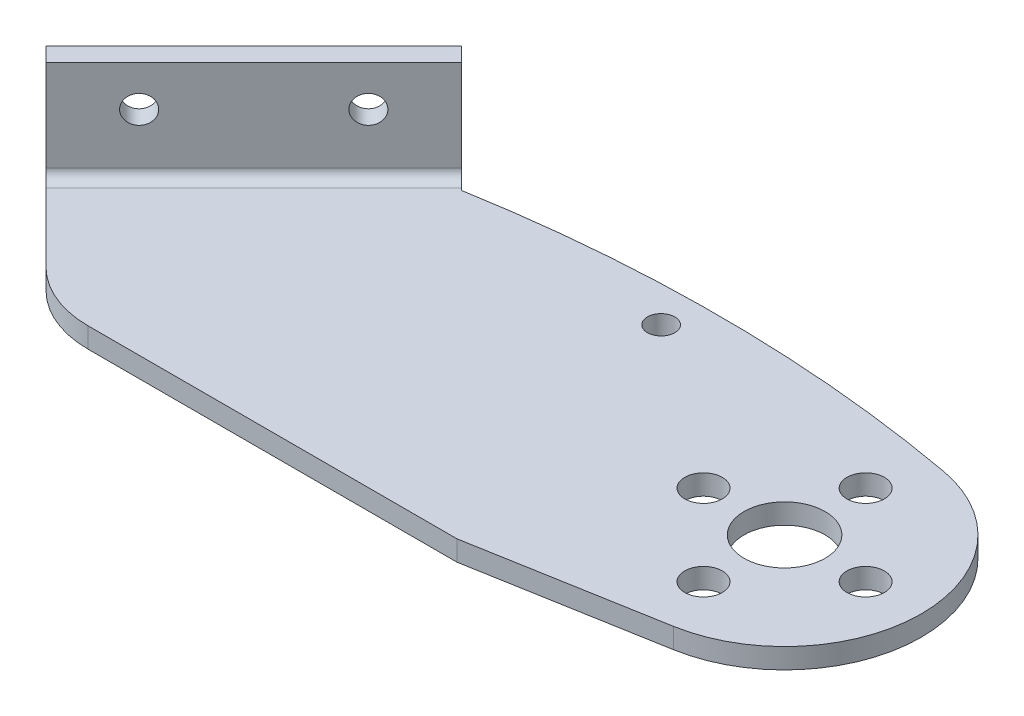
ISO-10303-21;
HEADER;
FILE_DESCRIPTION(('STEP AP214'),'2;1');
FILE_NAME('part.step','',(''),(''),'','','');
FILE_SCHEMA(('AUTOMOTIVE_DESIGN { 1 0 10303 214 1 1 1 1 }'));
ENDSEC;
DATA;
#1=APPLICATION_CONTEXT('core data for automotive mechanical design processes');
#2=APPLICATION_PROTOCOL_DEFINITION('international standard','automotive_design',2000,#1);
#3=PRODUCT_CONTEXT('',#1,'mechanical');
#4=PRODUCT('Part','Part','',(#3));
#5=PRODUCT_RELATED_PRODUCT_CATEGORY('part','',(#4));
#6=PRODUCT_DEFINITION_FORMATION('','',#4);
#7=PRODUCT_DEFINITION_CONTEXT('part definition',#1,'design');
#8=PRODUCT_DEFINITION('design','',#6,#7);
#9=PRODUCT_DEFINITION_SHAPE('','',#8);
#10=(LENGTH_UNIT() NAMED_UNIT(*) SI_UNIT(.MILLI.,.METRE.));
#11=(NAMED_UNIT(*) PLANE_ANGLE_UNIT() SI_UNIT($,.RADIAN.));
#12=(NAMED_UNIT(*) SI_UNIT($,.STERADIAN.) SOLID_ANGLE_UNIT());
#13=UNCERTAINTY_MEASURE_WITH_UNIT(LENGTH_MEASURE(1.E-05),#10,'distance_accuracy_value','');
#14=(GEOMETRIC_REPRESENTATION_CONTEXT(3) GLOBAL_UNCERTAINTY_ASSIGNED_CONTEXT((#13)) GLOBAL_UNIT_ASSIGNED_CONTEXT((#10,
#11,#12)) REPRESENTATION_CONTEXT('',''));
#15=CARTESIAN_POINT('',(0.,0.,0.));
#16=DIRECTION('',(0.,0.,1.));
#17=DIRECTION('',(1.,0.,0.));
#18=AXIS2_PLACEMENT_3D('',#15,#16,#17);
#19=CARTESIAN_POINT('',(13.7940246351911,8.,-9.12741699796952));
#20=DIRECTION('',(-0.707106781186548,0.,-0.707106781186547));
#21=DIRECTION('',(-0.707106781186548,0.,0.707106781186548));
#22=AXIS2_PLACEMENT_3D('',#19,#20,#21);
#23=CYLINDRICAL_SURFACE('',#22,1.36525);
#24=CARTESIAN_POINT('',(11.6727042916315,8.,-11.2487373415292));
#25=DIRECTION('',(-0.707106781186548,0.,-0.707106781186547));
#26=DIRECTION('',(-0.707106781186548,0.,0.707106781186548));
#27=AXIS2_PLACEMENT_3D('',#24,#25,#26);
#28=CIRCLE('',#27,1.36525);
#29=CARTESIAN_POINT('',(10.7073267586166,8.,-10.2833598085142));
#30=VERTEX_POINT('',#29);
#31=EDGE_CURVE('E177',#30,#30,#28,.T.);
#32=ORIENTED_EDGE('',*,*,#31,.T.);
#33=EDGE_LOOP('',(#32));
#34=FACE_BOUND('',#33,.T.);
#35=CARTESIAN_POINT('',(13.0869178540046,8.,-9.83452377915606));
#36=DIRECTION('',(-0.707106781186548,0.,-0.707106781186548));
#37=DIRECTION('',(-0.707106781186548,0.,0.707106781186548));
#38=AXIS2_PLACEMENT_3D('',#35,#36,#37);
#39=CIRCLE('',#38,1.36525);
#40=CARTESIAN_POINT('',(12.1215403209897,8.,-8.86914624614113));
#41=VERTEX_POINT('',#40);
#42=EDGE_CURVE('E228',#41,#41,#39,.T.);
#43=ORIENTED_EDGE('',*,*,#42,.F.);
#44=EDGE_LOOP('',(#43));
#45=FACE_BOUND('',#44,.T.);
#46=ADVANCED_FACE('F50',(#34,#45),#23,.F.);
#47=CARTESIAN_POINT('',(2.48031613620638,8.,2.18629150101524));
#48=DIRECTION('',(-0.707106781186548,0.,-0.707106781186547));
#49=DIRECTION('',(-0.707106781186548,0.,0.707106781186548));
#50=AXIS2_PLACEMENT_3D('',#47,#48,#49);
#51=CYLINDRICAL_SURFACE('',#50,1.36525);
#52=CARTESIAN_POINT('',(0.358995792646737,8.,0.0649711574556003));
#53=DIRECTION('',(-0.707106781186548,0.,-0.707106781186547));
#54=DIRECTION('',(-0.707106781186548,0.,0.707106781186548));
#55=AXIS2_PLACEMENT_3D('',#52,#53,#54);
#56=CIRCLE('',#55,1.36525);
#57=CARTESIAN_POINT('',(-0.606381740368197,8.,1.03034869047053));
#58=VERTEX_POINT('',#57);
#59=EDGE_CURVE('E247',#58,#58,#56,.T.);
#60=ORIENTED_EDGE('',*,*,#59,.T.);
#61=EDGE_LOOP('',(#60));
#62=FACE_BOUND('',#61,.T.);
#63=CARTESIAN_POINT('',(1.77320935501983,8.,1.4791847198287));
#64=DIRECTION('',(-0.707106781186548,0.,-0.707106781186548));
#65=DIRECTION('',(-0.707106781186548,0.,0.707106781186548));
#66=AXIS2_PLACEMENT_3D('',#63,#64,#65);
#67=CIRCLE('',#66,1.36525);
#68=CARTESIAN_POINT('',(0.8078318220049,8.,2.44456225284363));
#69=VERTEX_POINT('',#68);
#70=EDGE_CURVE('E233',#69,#69,#67,.T.);
#71=ORIENTED_EDGE('',*,*,#70,.F.);
#72=EDGE_LOOP('',(#71));
#73=FACE_BOUND('',#72,.T.);
#74=ADVANCED_FACE('F266',(#62,#73),#51,.F.);
#75=CARTESIAN_POINT('',(70.0090137395217,12.,37.8951839509359));
#76=DIRECTION('',(0.,1.,0.));
#77=DIRECTION('',(-0.707106781186548,0.,0.707106781186548));
#78=AXIS2_PLACEMENT_3D('',#75,#76,#77);
#79=PLANE('',#78);
#80=DIRECTION('',(-0.707106781186548,0.,-0.707106781186548));
#81=VECTOR('',#80,1.);
#82=CARTESIAN_POINT('',(70.0090137395217,12.,37.8951839509359));
#83=LINE('',#82,#81);
#84=CARTESIAN_POINT('',(17.6831119317172,12.,-14.4307178568686));
#85=VERTEX_POINT('',#84);
#86=CARTESIAN_POINT('',(16.2688983693441,12.,-15.8449314192417));
#87=VERTEX_POINT('',#86);
#88=EDGE_CURVE('E245',#85,#87,#83,.T.);
#89=ORIENTED_EDGE('',*,*,#88,.T.);
#90=DIRECTION('',(-0.707106781186547,0.,0.707106781186547));
#91=VECTOR('',#90,1.);
#92=CARTESIAN_POINT('',(16.2688983693441,12.,-15.8449314192417));
#93=LINE('',#92,#91);
#94=CARTESIAN_POINT('',(-4.23719828506582,12.,4.66116523516816));
#95=VERTEX_POINT('',#94);
#96=EDGE_CURVE('E158',#87,#95,#93,.T.);
#97=ORIENTED_EDGE('',*,*,#96,.T.);
#98=DIRECTION('',(-0.707106781186548,0.,-0.707106781186548));
#99=VECTOR('',#98,1.);
#100=CARTESIAN_POINT('',(49.5029170851118,12.,58.4012806053458));
#101=LINE('',#100,#99);
#102=CARTESIAN_POINT('',(-2.82298472269272,12.,6.07537879754126));
#103=VERTEX_POINT('',#102);
#104=EDGE_CURVE('E236',#103,#95,#101,.T.);
#105=ORIENTED_EDGE('',*,*,#104,.F.);
#106=DIRECTION('',(0.707106781186547,0.,-0.707106781186547));
#107=VECTOR('',#106,1.);
#108=CARTESIAN_POINT('',(17.6831119317172,12.,-14.4307178568686));
#109=LINE('',#108,#107);
#110=EDGE_CURVE('E69',#103,#85,#109,.T.);
#111=ORIENTED_EDGE('',*,*,#110,.T.);
#112=EDGE_LOOP('',(#89,#97,#105,#111));
#113=FACE_BOUND('',#112,.T.);
#114=ADVANCED_FACE('F263',(#113),#79,.T.);
#115=CARTESIAN_POINT('',(70.0090137395217,12.,37.8951839509359));
#116=DIRECTION('',(0.707106781186548,0.,-0.707106781186548));
#117=DIRECTION('',(0.,1.,0.));
#118=AXIS2_PLACEMENT_3D('',#115,#116,#117);
#119=PLANE('',#118);
#120=DIRECTION('',(-0.707106781186548,0.,-0.707106781186548));
#121=VECTOR('',#120,1.);
#122=CARTESIAN_POINT('',(70.0090137395217,3.,37.8951839509359));
#123=LINE('',#122,#121);
#124=CARTESIAN_POINT('',(17.6831119317172,2.99999999999999,-14.4307178568686));
#125=VERTEX_POINT('',#124);
#126=CARTESIAN_POINT('',(16.2688983693441,2.99999999999998,-15.8449314192417));
#127=VERTEX_POINT('',#126);
#128=EDGE_CURVE('E160',#125,#127,#123,.T.);
#129=ORIENTED_EDGE('',*,*,#128,.T.);
#130=DIRECTION('',(0.,1.,0.));
#131=VECTOR('',#130,1.);
#132=CARTESIAN_POINT('',(16.2688983693441,0.,-15.8449314192417));
#133=LINE('',#132,#131);
#134=EDGE_CURVE('E94',#127,#87,#133,.T.);
#135=ORIENTED_EDGE('',*,*,#134,.T.);
#136=ORIENTED_EDGE('',*,*,#88,.F.);
#137=DIRECTION('',(0.,-1.,0.));
#138=VECTOR('',#137,1.);
#139=CARTESIAN_POINT('',(17.6831119317172,12.,-14.4307178568686));
#140=LINE('',#139,#138);
#141=EDGE_CURVE('E159',#85,#125,#140,.T.);
#142=ORIENTED_EDGE('',*,*,#141,.T.);
#143=EDGE_LOOP('',(#129,#135,#136,#142));
#144=FACE_BOUND('',#143,.T.);
#145=ADVANCED_FACE('F164',(#144),#119,.T.);
#146=CARTESIAN_POINT('',(16.2688983693441,0.,-15.8449314192417));
#147=DIRECTION('',(-0.707106781186547,0.,-0.707106781186548));
#148=DIRECTION('',(-0.707106781186548,0.,0.707106781186548));
#149=AXIS2_PLACEMENT_3D('',#146,#147,#148);
#150=PLANE('',#149);
#151=DIRECTION('',(0.707106781186548,0.,-0.707106781186547));
#152=VECTOR('',#151,1.);
#153=CARTESIAN_POINT('',(16.2688983693441,3.,-15.8449314192417));
#154=LINE('',#153,#152);
#155=CARTESIAN_POINT('',(-4.23719828506582,3.,4.66116523516816));
#156=VERTEX_POINT('',#155);
#157=EDGE_CURVE('E88',#156,#127,#154,.T.);
#158=ORIENTED_EDGE('',*,*,#157,.F.);
#159=DIRECTION('',(0.,1.,0.));
#160=VECTOR('',#159,1.);
#161=CARTESIAN_POINT('',(-4.23719828506582,12.,4.66116523516816));
#162=LINE('',#161,#160);
#163=EDGE_CURVE('E238',#156,#95,#162,.T.);
#164=ORIENTED_EDGE('',*,*,#163,.T.);
#165=ORIENTED_EDGE('',*,*,#96,.F.);
#166=ORIENTED_EDGE('',*,*,#134,.F.);
#167=EDGE_LOOP('',(#158,#164,#165,#166));
#168=FACE_BOUND('',#167,.T.);
#169=ORIENTED_EDGE('',*,*,#59,.F.);
#170=EDGE_LOOP('',(#169));
#171=FACE_BOUND('',#170,.T.);
#172=ORIENTED_EDGE('',*,*,#31,.F.);
#173=EDGE_LOOP('',(#172));
#174=FACE_BOUND('',#173,.T.);
#175=ADVANCED_FACE('F155',(#168,#171,#174),#150,.T.);
#176=CARTESIAN_POINT('',(49.5029170851118,12.,58.4012806053458));
#177=DIRECTION('',(0.707106781186548,0.,-0.707106781186548));
#178=DIRECTION('',(0.,1.,0.));
#179=AXIS2_PLACEMENT_3D('',#176,#177,#178);
#180=PLANE('',#179);
#181=ORIENTED_EDGE('',*,*,#163,.F.);
#182=DIRECTION('',(-0.707106781186548,0.,-0.707106781186548));
#183=VECTOR('',#182,1.);
#184=CARTESIAN_POINT('',(49.5029170851118,3.,58.4012806053458));
#185=LINE('',#184,#183);
#186=CARTESIAN_POINT('',(-2.82298472269272,3.,6.07537879754126));
#187=VERTEX_POINT('',#186);
#188=EDGE_CURVE('E54',#187,#156,#185,.T.);
#189=ORIENTED_EDGE('',*,*,#188,.F.);
#190=DIRECTION('',(0.,-1.,0.));
#191=VECTOR('',#190,1.);
#192=CARTESIAN_POINT('',(-2.82298472269272,12.,6.07537879754126));
#193=LINE('',#192,#191);
#194=EDGE_CURVE('E60',#103,#187,#193,.T.);
#195=ORIENTED_EDGE('',*,*,#194,.F.);
#196=ORIENTED_EDGE('',*,*,#104,.T.);
#197=EDGE_LOOP('',(#181,#189,#195,#196));
#198=FACE_BOUND('',#197,.T.);
#199=ADVANCED_FACE('F256',(#198),#180,.F.);
#200=CARTESIAN_POINT('',(17.6831119317172,12.,-14.4307178568686));
#201=DIRECTION('',(-0.707106781186548,0.,-0.707106781186548));
#202=DIRECTION('',(-0.707106781186548,0.,0.707106781186548));
#203=AXIS2_PLACEMENT_3D('',#200,#201,#202);
#204=PLANE('',#203);
#205=ORIENTED_EDGE('',*,*,#70,.T.);
#206=EDGE_LOOP('',(#205));
#207=FACE_BOUND('',#206,.T.);
#208=ORIENTED_EDGE('',*,*,#42,.T.);
#209=EDGE_LOOP('',(#208));
#210=FACE_BOUND('',#209,.T.);
#211=ORIENTED_EDGE('',*,*,#194,.T.);
#212=DIRECTION('',(0.707106781186548,0.,-0.707106781186548));
#213=VECTOR('',#212,1.);
#214=CARTESIAN_POINT('',(17.6831119317172,3.,-14.4307178568686));
#215=LINE('',#214,#213);
#216=EDGE_CURVE('E13',#187,#125,#215,.T.);
#217=ORIENTED_EDGE('',*,*,#216,.T.);
#218=ORIENTED_EDGE('',*,*,#141,.F.);
#219=ORIENTED_EDGE('',*,*,#110,.F.);
#220=EDGE_LOOP('',(#211,#217,#218,#219));
#221=FACE_BOUND('',#220,.T.);
#222=ADVANCED_FACE('F52',(#207,#210,#221),#204,.F.);
#223=CARTESIAN_POINT('',(64.,0.,0.));
#224=DIRECTION('',(0.,1.,0.));
#225=DIRECTION('',(0.,0.,1.));
#226=AXIS2_PLACEMENT_3D('',#223,#224,#225);
#227=PLANE('',#226);
#228=CARTESIAN_POINT('',(56.,0.,0.));
#229=DIRECTION('',(0.,1.,0.));
#230=DIRECTION('',(0.,0.,-1.));
#231=AXIS2_PLACEMENT_3D('',#228,#229,#230);
#232=CIRCLE('',#231,1.85);
#233=CARTESIAN_POINT('',(56.,0.,-1.85));
#234=VERTEX_POINT('',#233);
#235=EDGE_CURVE('E365',#234,#234,#232,.T.);
#236=ORIENTED_EDGE('',*,*,#235,.T.);
#237=EDGE_LOOP('',(#236));
#238=FACE_BOUND('',#237,.T.);
#239=CARTESIAN_POINT('',(64.,0.,8.));
#240=DIRECTION('',(0.,1.,0.));
#241=DIRECTION('',(0.,0.,-1.));
#242=AXIS2_PLACEMENT_3D('',#239,#240,#241);
#243=CIRCLE('',#242,1.85);
#244=CARTESIAN_POINT('',(64.,0.,6.15));
#245=VERTEX_POINT('',#244);
#246=EDGE_CURVE('E362',#245,#245,#243,.T.);
#247=ORIENTED_EDGE('',*,*,#246,.T.);
#248=EDGE_LOOP('',(#247));
#249=FACE_BOUND('',#248,.T.);
#250=CARTESIAN_POINT('',(72.,0.,0.));
#251=DIRECTION('',(0.,1.,0.));
#252=DIRECTION('',(0.,0.,-1.));
#253=AXIS2_PLACEMENT_3D('',#250,#251,#252);
#254=CIRCLE('',#253,1.85);
#255=CARTESIAN_POINT('',(72.,0.,-1.85));
#256=VERTEX_POINT('',#255);
#257=EDGE_CURVE('E359',#256,#256,#254,.T.);
#258=ORIENTED_EDGE('',*,*,#257,.T.);
#259=EDGE_LOOP('',(#258));
#260=FACE_BOUND('',#259,.T.);
#261=CARTESIAN_POINT('',(64.,0.,-8.));
#262=DIRECTION('',(0.,1.,0.));
#263=DIRECTION('',(0.,0.,-1.));
#264=AXIS2_PLACEMENT_3D('',#261,#262,#263);
#265=CIRCLE('',#264,1.85);
#266=CARTESIAN_POINT('',(64.,0.,-9.85));
#267=VERTEX_POINT('',#266);
#268=EDGE_CURVE('E356',#267,#267,#265,.T.);
#269=ORIENTED_EDGE('',*,*,#268,.T.);
#270=EDGE_LOOP('',(#269));
#271=FACE_BOUND('',#270,.T.);
#272=CARTESIAN_POINT('',(64.,0.,0.));
#273=DIRECTION('',(0.,1.,0.));
#274=DIRECTION('',(0.,0.,-1.));
#275=AXIS2_PLACEMENT_3D('',#272,#273,#274);
#276=CIRCLE('',#275,4.);
#277=CARTESIAN_POINT('',(64.,0.,-4.));
#278=VERTEX_POINT('',#277);
#279=EDGE_CURVE('E353',#278,#278,#276,.T.);
#280=ORIENTED_EDGE('',*,*,#279,.T.);
#281=EDGE_LOOP('',(#280));
#282=FACE_BOUND('',#281,.T.);
#283=CARTESIAN_POINT('',(39.9467553839433,0.,-11.8675875071896));
#284=DIRECTION('',(0.,1.,0.));
#285=DIRECTION('',(0.,0.,1.));
#286=AXIS2_PLACEMENT_3D('',#283,#284,#285);
#287=CIRCLE('',#286,1.35255);
#288=CARTESIAN_POINT('',(39.9467553839433,0.,-10.5150375071896));
#289=VERTEX_POINT('',#288);
#290=EDGE_CURVE('E350',#289,#289,#287,.T.);
#291=ORIENTED_EDGE('',*,*,#290,.T.);
#292=EDGE_LOOP('',(#291));
#293=FACE_BOUND('',#292,.T.);
#294=DIRECTION('',(-0.707106781186548,0.,0.707106781186548));
#295=VECTOR('',#294,1.);
#296=CARTESIAN_POINT('',(18.3902187129037,0.,-13.7236110756821));
#297=LINE('',#296,#295);
#298=CARTESIAN_POINT('',(18.3902187129037,0.,-13.7236110756821));
#299=VERTEX_POINT('',#298);
#300=CARTESIAN_POINT('',(-2.11587794150619,0.,6.78248557872778));
#301=VERTEX_POINT('',#300);
#302=EDGE_CURVE('E205',#299,#301,#297,.T.);
#303=ORIENTED_EDGE('',*,*,#302,.F.);
#304=DIRECTION('',(-0.707106781186547,0.,-0.707106781186548));
#305=VECTOR('',#304,1.);
#306=CARTESIAN_POINT('',(18.6138297885858,0.,-13.5));
#307=LINE('',#306,#305);
#308=CARTESIAN_POINT('',(18.6138297885858,0.,-13.5));
#309=VERTEX_POINT('',#308);
#310=EDGE_CURVE('E303',#309,#299,#307,.T.);
#311=ORIENTED_EDGE('',*,*,#310,.F.);
#312=CARTESIAN_POINT('',(41.9018097680888,0.,121.082502881433));
#313=DIRECTION('',(0.,1.,0.));
#314=DIRECTION('',(0.,0.,-1.));
#315=AXIS2_PLACEMENT_3D('',#312,#313,#314);
#316=CIRCLE('',#315,136.582502881433);
#317=CARTESIAN_POINT('',(66.423785356544,0.,-13.2806349451148));
#318=VERTEX_POINT('',#317);
#319=EDGE_CURVE('E306',#318,#309,#316,.T.);
#320=ORIENTED_EDGE('',*,*,#319,.F.);
#321=CARTESIAN_POINT('',(64.,0.,0.));
#322=DIRECTION('',(0.,1.,0.));
#323=DIRECTION('',(0.,0.,1.));
#324=AXIS2_PLACEMENT_3D('',#321,#322,#323);
#325=CIRCLE('',#324,13.5);
#326=CARTESIAN_POINT('',(66.3442503985036,0.,13.2949046656648));
#327=VERTEX_POINT('',#326);
#328=EDGE_CURVE('E309',#327,#318,#325,.T.);
#329=ORIENTED_EDGE('',*,*,#328,.F.);
#330=DIRECTION('',(0.984807753012208,0.,-0.173648177666931));
#331=VECTOR('',#330,1.);
#332=CARTESIAN_POINT('',(48.167251498747,0.,16.5));
#333=LINE('',#332,#331);
#334=CARTESIAN_POINT('',(48.167251498747,0.,16.5));
#335=VERTEX_POINT('',#334);
#336=EDGE_CURVE('E200',#335,#327,#333,.T.);
#337=ORIENTED_EDGE('',*,*,#336,.F.);
#338=DIRECTION('',(1.,0.,0.));
#339=VECTOR('',#338,1.);
#340=CARTESIAN_POINT('',(7.60163647976604,0.,16.5));
#341=LINE('',#340,#339);
#342=CARTESIAN_POINT('',(11.743772103497,0.,16.5));
#343=VERTEX_POINT('',#342);
#344=EDGE_CURVE('E368',#343,#335,#341,.T.);
#345=ORIENTED_EDGE('',*,*,#344,.F.);
#346=CARTESIAN_POINT('',(11.743772103497,0.,6.5));
#347=DIRECTION('',(0.,1.,0.));
#348=DIRECTION('',(0.,0.,1.));
#349=AXIS2_PLACEMENT_3D('',#346,#347,#348);
#350=CIRCLE('',#349,10.);
#351=CARTESIAN_POINT('',(4.67270429163152,0.,13.5710678118655));
#352=VERTEX_POINT('',#351);
#353=EDGE_CURVE('E311',#343,#352,#350,.F.);
#354=ORIENTED_EDGE('',*,*,#353,.T.);
#355=DIRECTION('',(0.707106781186548,0.,0.707106781186547));
#356=VECTOR('',#355,1.);
#357=CARTESIAN_POINT('',(-4.23719828506582,0.,4.66116523516815));
#358=LINE('',#357,#356);
#359=EDGE_CURVE('E307',#301,#352,#358,.T.);
#360=ORIENTED_EDGE('',*,*,#359,.F.);
#361=EDGE_LOOP('',(#303,#311,#320,#329,#337,#345,#354,#360));
#362=FACE_BOUND('',#361,.T.);
#363=ADVANCED_FACE('F371',(#238,#249,#260,#271,#282,#293,#362),#227,.F.);
#364=CARTESIAN_POINT('',(64.,2.,0.));
#365=DIRECTION('',(0.,1.,0.));
#366=DIRECTION('',(0.,0.,1.));
#367=AXIS2_PLACEMENT_3D('',#364,#365,#366);
#368=PLANE('',#367);
#369=CARTESIAN_POINT('',(39.9467553839433,2.,-11.8675875071896));
#370=DIRECTION('',(0.,1.,0.));
#371=DIRECTION('',(0.,0.,1.));
#372=AXIS2_PLACEMENT_3D('',#369,#370,#371);
#373=CIRCLE('',#372,1.35255);
#374=CARTESIAN_POINT('',(39.9467553839433,2.,-10.5150375071896));
#375=VERTEX_POINT('',#374);
#376=EDGE_CURVE('E183',#375,#375,#373,.F.);
#377=ORIENTED_EDGE('',*,*,#376,.T.);
#378=EDGE_LOOP('',(#377));
#379=FACE_BOUND('',#378,.T.);
#380=CARTESIAN_POINT('',(64.,2.,0.));
#381=DIRECTION('',(0.,1.,0.));
#382=DIRECTION('',(0.,0.,-1.));
#383=AXIS2_PLACEMENT_3D('',#380,#381,#382);
#384=CIRCLE('',#383,4.);
#385=CARTESIAN_POINT('',(64.,2.,-4.));
#386=VERTEX_POINT('',#385);
#387=EDGE_CURVE('E333',#386,#386,#384,.T.);
#388=ORIENTED_EDGE('',*,*,#387,.F.);
#389=EDGE_LOOP('',(#388));
#390=FACE_BOUND('',#389,.T.);
#391=CARTESIAN_POINT('',(64.,2.,-8.));
#392=DIRECTION('',(0.,1.,0.));
#393=DIRECTION('',(0.,0.,-1.));
#394=AXIS2_PLACEMENT_3D('',#391,#392,#393);
#395=CIRCLE('',#394,1.85);
#396=CARTESIAN_POINT('',(64.,2.,-9.85));
#397=VERTEX_POINT('',#396);
#398=EDGE_CURVE('E338',#397,#397,#395,.T.);
#399=ORIENTED_EDGE('',*,*,#398,.F.);
#400=EDGE_LOOP('',(#399));
#401=FACE_BOUND('',#400,.T.);
#402=CARTESIAN_POINT('',(72.,2.,0.));
#403=DIRECTION('',(0.,1.,0.));
#404=DIRECTION('',(0.,0.,-1.));
#405=AXIS2_PLACEMENT_3D('',#402,#403,#404);
#406=CIRCLE('',#405,1.85);
#407=CARTESIAN_POINT('',(72.,2.,-1.85));
#408=VERTEX_POINT('',#407);
#409=EDGE_CURVE('E341',#408,#408,#406,.T.);
#410=ORIENTED_EDGE('',*,*,#409,.F.);
#411=EDGE_LOOP('',(#410));
#412=FACE_BOUND('',#411,.T.);
#413=CARTESIAN_POINT('',(64.,2.,8.));
#414=DIRECTION('',(0.,1.,0.));
#415=DIRECTION('',(0.,0.,-1.));
#416=AXIS2_PLACEMENT_3D('',#413,#414,#415);
#417=CIRCLE('',#416,1.85);
#418=CARTESIAN_POINT('',(64.,2.,6.15));
#419=VERTEX_POINT('',#418);
#420=EDGE_CURVE('E344',#419,#419,#417,.T.);
#421=ORIENTED_EDGE('',*,*,#420,.F.);
#422=EDGE_LOOP('',(#421));
#423=FACE_BOUND('',#422,.T.);
#424=CARTESIAN_POINT('',(56.,2.,0.));
#425=DIRECTION('',(0.,1.,0.));
#426=DIRECTION('',(0.,0.,-1.));
#427=AXIS2_PLACEMENT_3D('',#424,#425,#426);
#428=CIRCLE('',#427,1.85);
#429=CARTESIAN_POINT('',(56.,2.,-1.85));
#430=VERTEX_POINT('',#429);
#431=EDGE_CURVE('E347',#430,#430,#428,.T.);
#432=ORIENTED_EDGE('',*,*,#431,.F.);
#433=EDGE_LOOP('',(#432));
#434=FACE_BOUND('',#433,.T.);
#435=DIRECTION('',(-0.707106781186547,0.,-0.707106781186548));
#436=VECTOR('',#435,1.);
#437=CARTESIAN_POINT('',(18.6138297885858,2.,-13.5));
#438=LINE('',#437,#436);
#439=CARTESIAN_POINT('',(18.6138297885858,2.,-13.5));
#440=VERTEX_POINT('',#439);
#441=CARTESIAN_POINT('',(18.3902187129037,2.,-13.7236110756821));
#442=VERTEX_POINT('',#441);
#443=EDGE_CURVE('E300',#440,#442,#438,.T.);
#444=ORIENTED_EDGE('',*,*,#443,.T.);
#445=DIRECTION('',(-0.707106781186548,0.,0.707106781186548));
#446=VECTOR('',#445,1.);
#447=CARTESIAN_POINT('',(18.3902187129037,2.,-13.7236110756821));
#448=LINE('',#447,#446);
#449=CARTESIAN_POINT('',(-2.11587794150617,2.,6.78248557872779));
#450=VERTEX_POINT('',#449);
#451=EDGE_CURVE('E202',#442,#450,#448,.T.);
#452=ORIENTED_EDGE('',*,*,#451,.T.);
#453=DIRECTION('',(0.707106781186548,0.,0.707106781186547));
#454=VECTOR('',#453,1.);
#455=CARTESIAN_POINT('',(-4.23719828506582,2.,4.66116523516815));
#456=LINE('',#455,#454);
#457=CARTESIAN_POINT('',(4.67270429163152,2.,13.5710678118655));
#458=VERTEX_POINT('',#457);
#459=EDGE_CURVE('E192',#450,#458,#456,.T.);
#460=ORIENTED_EDGE('',*,*,#459,.T.);
#461=CARTESIAN_POINT('',(11.743772103497,2.,6.5));
#462=DIRECTION('',(0.,1.,0.));
#463=DIRECTION('',(0.,0.,1.));
#464=AXIS2_PLACEMENT_3D('',#461,#462,#463);
#465=CIRCLE('',#464,10.);
#466=CARTESIAN_POINT('',(11.743772103497,2.,16.5));
#467=VERTEX_POINT('',#466);
#468=EDGE_CURVE('E102',#458,#467,#465,.T.);
#469=ORIENTED_EDGE('',*,*,#468,.T.);
#470=DIRECTION('',(1.,0.,0.));
#471=VECTOR('',#470,1.);
#472=CARTESIAN_POINT('',(7.60163647976604,2.,16.5));
#473=LINE('',#472,#471);
#474=CARTESIAN_POINT('',(48.167251498747,2.,16.5));
#475=VERTEX_POINT('',#474);
#476=EDGE_CURVE('E110',#467,#475,#473,.T.);
#477=ORIENTED_EDGE('',*,*,#476,.T.);
#478=DIRECTION('',(0.984807753012208,0.,-0.173648177666931));
#479=VECTOR('',#478,1.);
#480=CARTESIAN_POINT('',(48.167251498747,2.,16.5));
#481=LINE('',#480,#479);
#482=CARTESIAN_POINT('',(66.3442503985036,2.,13.2949046656648));
#483=VERTEX_POINT('',#482);
#484=EDGE_CURVE('E327',#475,#483,#481,.T.);
#485=ORIENTED_EDGE('',*,*,#484,.T.);
#486=CARTESIAN_POINT('',(64.,2.,0.));
#487=DIRECTION('',(0.,1.,0.));
#488=DIRECTION('',(0.,0.,1.));
#489=AXIS2_PLACEMENT_3D('',#486,#487,#488);
#490=CIRCLE('',#489,13.5);
#491=CARTESIAN_POINT('',(66.423785356544,2.,-13.2806349451148));
#492=VERTEX_POINT('',#491);
#493=EDGE_CURVE('E325',#483,#492,#490,.T.);
#494=ORIENTED_EDGE('',*,*,#493,.T.);
#495=CARTESIAN_POINT('',(41.9018097680888,2.,121.082502881433));
#496=DIRECTION('',(0.,1.,0.));
#497=DIRECTION('',(0.,0.,-1.));
#498=AXIS2_PLACEMENT_3D('',#495,#496,#497);
#499=CIRCLE('',#498,136.582502881433);
#500=EDGE_CURVE('E326',#492,#440,#499,.T.);
#501=ORIENTED_EDGE('',*,*,#500,.T.);
#502=EDGE_LOOP('',(#444,#452,#460,#469,#477,#485,#494,#501));
#503=FACE_BOUND('',#502,.T.);
#504=ADVANCED_FACE('F297',(#379,#390,#401,#412,#423,#434,#503),#368,.T.);
#505=CARTESIAN_POINT('',(56.,0.,0.));
#506=DIRECTION('',(0.,1.,0.));
#507=DIRECTION('',(0.,0.,1.));
#508=AXIS2_PLACEMENT_3D('',#505,#506,#507);
#509=CYLINDRICAL_SURFACE('',#508,1.85);
#510=ORIENTED_EDGE('',*,*,#235,.F.);
#511=EDGE_LOOP('',(#510));
#512=FACE_BOUND('',#511,.T.);
#513=ORIENTED_EDGE('',*,*,#431,.T.);
#514=EDGE_LOOP('',(#513));
#515=FACE_BOUND('',#514,.T.);
#516=ADVANCED_FACE('F390',(#512,#515),#509,.F.);
#517=CARTESIAN_POINT('',(64.,0.,8.));
#518=DIRECTION('',(0.,1.,0.));
#519=DIRECTION('',(0.,0.,1.));
#520=AXIS2_PLACEMENT_3D('',#517,#518,#519);
#521=CYLINDRICAL_SURFACE('',#520,1.85);
#522=ORIENTED_EDGE('',*,*,#246,.F.);
#523=EDGE_LOOP('',(#522));
#524=FACE_BOUND('',#523,.T.);
#525=ORIENTED_EDGE('',*,*,#420,.T.);
#526=EDGE_LOOP('',(#525));
#527=FACE_BOUND('',#526,.T.);
#528=ADVANCED_FACE('F393',(#524,#527),#521,.F.);
#529=CARTESIAN_POINT('',(72.,0.,0.));
#530=DIRECTION('',(0.,1.,0.));
#531=DIRECTION('',(0.,0.,1.));
#532=AXIS2_PLACEMENT_3D('',#529,#530,#531);
#533=CYLINDRICAL_SURFACE('',#532,1.85);
#534=ORIENTED_EDGE('',*,*,#257,.F.);
#535=EDGE_LOOP('',(#534));
#536=FACE_BOUND('',#535,.T.);
#537=ORIENTED_EDGE('',*,*,#409,.T.);
#538=EDGE_LOOP('',(#537));
#539=FACE_BOUND('',#538,.T.);
#540=ADVANCED_FACE('F397',(#536,#539),#533,.F.);
#541=CARTESIAN_POINT('',(64.,0.,-8.));
#542=DIRECTION('',(0.,1.,0.));
#543=DIRECTION('',(0.,0.,1.));
#544=AXIS2_PLACEMENT_3D('',#541,#542,#543);
#545=CYLINDRICAL_SURFACE('',#544,1.85);
#546=ORIENTED_EDGE('',*,*,#268,.F.);
#547=EDGE_LOOP('',(#546));
#548=FACE_BOUND('',#547,.T.);
#549=ORIENTED_EDGE('',*,*,#398,.T.);
#550=EDGE_LOOP('',(#549));
#551=FACE_BOUND('',#550,.T.);
#552=ADVANCED_FACE('F401',(#548,#551),#545,.F.);
#553=CARTESIAN_POINT('',(64.,0.,0.));
#554=DIRECTION('',(0.,1.,0.));
#555=DIRECTION('',(0.,0.,1.));
#556=AXIS2_PLACEMENT_3D('',#553,#554,#555);
#557=CYLINDRICAL_SURFACE('',#556,4.);
#558=ORIENTED_EDGE('',*,*,#279,.F.);
#559=EDGE_LOOP('',(#558));
#560=FACE_BOUND('',#559,.T.);
#561=ORIENTED_EDGE('',*,*,#387,.T.);
#562=EDGE_LOOP('',(#561));
#563=FACE_BOUND('',#562,.T.);
#564=ADVANCED_FACE('F405',(#560,#563),#557,.F.);
#565=CARTESIAN_POINT('',(39.9467553839433,6.,-11.8675875071896));
#566=DIRECTION('',(0.,-1.,0.));
#567=DIRECTION('',(0.,0.,-1.));
#568=AXIS2_PLACEMENT_3D('',#565,#566,#567);
#569=CYLINDRICAL_SURFACE('',#568,1.35255);
#570=ORIENTED_EDGE('',*,*,#376,.F.);
#571=EDGE_LOOP('',(#570));
#572=FACE_BOUND('',#571,.T.);
#573=ORIENTED_EDGE('',*,*,#290,.F.);
#574=EDGE_LOOP('',(#573));
#575=FACE_BOUND('',#574,.T.);
#576=ADVANCED_FACE('F409',(#572,#575),#569,.F.);
#577=CARTESIAN_POINT('',(18.6138297885858,171.612214255242,-13.5));
#578=DIRECTION('',(-0.707106781186548,0.,0.707106781186547));
#579=DIRECTION('',(0.707106781186547,0.,0.707106781186548));
#580=AXIS2_PLACEMENT_3D('',#577,#578,#579);
#581=PLANE('',#580);
#582=DIRECTION('',(0.,-1.,0.));
#583=VECTOR('',#582,1.);
#584=CARTESIAN_POINT('',(18.6138297885858,171.612214255242,-13.5));
#585=LINE('',#584,#583);
#586=EDGE_CURVE('E207',#440,#309,#585,.T.);
#587=ORIENTED_EDGE('',*,*,#586,.T.);
#588=ORIENTED_EDGE('',*,*,#310,.T.);
#589=DIRECTION('',(0.,-1.,0.));
#590=VECTOR('',#589,1.);
#591=CARTESIAN_POINT('',(18.3902187129037,171.612214255242,-13.7236110756821));
#592=LINE('',#591,#590);
#593=EDGE_CURVE('E180',#442,#299,#592,.T.);
#594=ORIENTED_EDGE('',*,*,#593,.F.);
#595=ORIENTED_EDGE('',*,*,#443,.F.);
#596=EDGE_LOOP('',(#587,#588,#594,#595));
#597=FACE_BOUND('',#596,.T.);
#598=ADVANCED_FACE('F274',(#597),#581,.F.);
#599=CARTESIAN_POINT('',(-4.23719828506582,171.612214255242,4.66116523516815));
#600=DIRECTION('',(0.707106781186547,0.,-0.707106781186548));
#601=DIRECTION('',(-0.707106781186548,0.,-0.707106781186547));
#602=AXIS2_PLACEMENT_3D('',#599,#600,#601);
#603=PLANE('',#602);
#604=DIRECTION('',(0.,-1.,0.));
#605=VECTOR('',#604,1.);
#606=CARTESIAN_POINT('',(-2.11587794150617,171.612214255242,6.78248557872779));
#607=LINE('',#606,#605);
#608=EDGE_CURVE('E223',#450,#301,#607,.T.);
#609=ORIENTED_EDGE('',*,*,#608,.T.);
#610=ORIENTED_EDGE('',*,*,#359,.T.);
#611=DIRECTION('',(0.,-1.,0.));
#612=VECTOR('',#611,1.);
#613=CARTESIAN_POINT('',(4.67270429163152,171.612214255242,13.5710678118655));
#614=LINE('',#613,#612);
#615=EDGE_CURVE('E221',#458,#352,#614,.T.);
#616=ORIENTED_EDGE('',*,*,#615,.F.);
#617=ORIENTED_EDGE('',*,*,#459,.F.);
#618=EDGE_LOOP('',(#609,#610,#616,#617));
#619=FACE_BOUND('',#618,.T.);
#620=ADVANCED_FACE('F294',(#619),#603,.F.);
#621=CARTESIAN_POINT('',(11.743772103497,171.612214255242,6.5));
#622=DIRECTION('',(0.,-1.,0.));
#623=DIRECTION('',(0.,0.,-1.));
#624=AXIS2_PLACEMENT_3D('',#621,#622,#623);
#625=CYLINDRICAL_SURFACE('',#624,10.);
#626=ORIENTED_EDGE('',*,*,#615,.T.);
#627=ORIENTED_EDGE('',*,*,#353,.F.);
#628=DIRECTION('',(0.,-1.,0.));
#629=VECTOR('',#628,1.);
#630=CARTESIAN_POINT('',(11.743772103497,171.612214255242,16.5));
#631=LINE('',#630,#629);
#632=EDGE_CURVE('E219',#467,#343,#631,.T.);
#633=ORIENTED_EDGE('',*,*,#632,.F.);
#634=ORIENTED_EDGE('',*,*,#468,.F.);
#635=EDGE_LOOP('',(#626,#627,#633,#634));
#636=FACE_BOUND('',#635,.T.);
#637=ADVANCED_FACE('F372',(#636),#625,.T.);
#638=CARTESIAN_POINT('',(7.60163647976604,171.612214255242,16.5));
#639=DIRECTION('',(0.,0.,-1.));
#640=DIRECTION('',(-1.,0.,0.));
#641=AXIS2_PLACEMENT_3D('',#638,#639,#640);
#642=PLANE('',#641);
#643=ORIENTED_EDGE('',*,*,#632,.T.);
#644=ORIENTED_EDGE('',*,*,#344,.T.);
#645=DIRECTION('',(0.,-1.,0.));
#646=VECTOR('',#645,1.);
#647=CARTESIAN_POINT('',(48.167251498747,171.612214255242,16.5));
#648=LINE('',#647,#646);
#649=EDGE_CURVE('E216',#475,#335,#648,.T.);
#650=ORIENTED_EDGE('',*,*,#649,.F.);
#651=ORIENTED_EDGE('',*,*,#476,.F.);
#652=EDGE_LOOP('',(#643,#644,#650,#651));
#653=FACE_BOUND('',#652,.T.);
#654=ADVANCED_FACE('F374',(#653),#642,.F.);
#655=CARTESIAN_POINT('',(48.167251498747,171.612214255242,16.5));
#656=DIRECTION('',(-0.173648177666931,0.,-0.984807753012208));
#657=DIRECTION('',(-0.984807753012208,0.,0.173648177666931));
#658=AXIS2_PLACEMENT_3D('',#655,#656,#657);
#659=PLANE('',#658);
#660=ORIENTED_EDGE('',*,*,#649,.T.);
#661=ORIENTED_EDGE('',*,*,#336,.T.);
#662=DIRECTION('',(0.,-1.,0.));
#663=VECTOR('',#662,1.);
#664=CARTESIAN_POINT('',(66.3442503985036,171.612214255242,13.2949046656648));
#665=LINE('',#664,#663);
#666=EDGE_CURVE('E213',#483,#327,#665,.T.);
#667=ORIENTED_EDGE('',*,*,#666,.F.);
#668=ORIENTED_EDGE('',*,*,#484,.F.);
#669=EDGE_LOOP('',(#660,#661,#667,#668));
#670=FACE_BOUND('',#669,.T.);
#671=ADVANCED_FACE('F320',(#670),#659,.F.);
#672=CARTESIAN_POINT('',(64.,171.612214255242,0.));
#673=DIRECTION('',(0.,-1.,0.));
#674=DIRECTION('',(0.,0.,-1.));
#675=AXIS2_PLACEMENT_3D('',#672,#673,#674);
#676=CYLINDRICAL_SURFACE('',#675,13.5);
#677=ORIENTED_EDGE('',*,*,#666,.T.);
#678=ORIENTED_EDGE('',*,*,#328,.T.);
#679=DIRECTION('',(0.,-1.,0.));
#680=VECTOR('',#679,1.);
#681=CARTESIAN_POINT('',(66.423785356544,171.612214255242,-13.2806349451148));
#682=LINE('',#681,#680);
#683=EDGE_CURVE('E210',#492,#318,#682,.T.);
#684=ORIENTED_EDGE('',*,*,#683,.F.);
#685=ORIENTED_EDGE('',*,*,#493,.F.);
#686=EDGE_LOOP('',(#677,#678,#684,#685));
#687=FACE_BOUND('',#686,.T.);
#688=ADVANCED_FACE('F323',(#687),#676,.T.);
#689=CARTESIAN_POINT('',(41.9018097680888,171.612214255242,121.082502881433));
#690=DIRECTION('',(0.,-1.,0.));
#691=DIRECTION('',(0.,0.,-1.));
#692=AXIS2_PLACEMENT_3D('',#689,#690,#691);
#693=CYLINDRICAL_SURFACE('',#692,136.582502881433);
#694=ORIENTED_EDGE('',*,*,#683,.T.);
#695=ORIENTED_EDGE('',*,*,#319,.T.);
#696=ORIENTED_EDGE('',*,*,#586,.F.);
#697=ORIENTED_EDGE('',*,*,#500,.F.);
#698=EDGE_LOOP('',(#694,#695,#696,#697));
#699=FACE_BOUND('',#698,.T.);
#700=ADVANCED_FACE('F386',(#699),#693,.T.);
#701=CARTESIAN_POINT('',(-2.11587794150618,3.,6.78248557872782));
#702=DIRECTION('',(-0.707106781186547,0.,0.707106781186549));
#703=DIRECTION('',(0.707106781186549,0.,0.707106781186547));
#704=AXIS2_PLACEMENT_3D('',#701,#702,#703);
#705=PLANE('',#704);
#706=ORIENTED_EDGE('',*,*,#608,.F.);
#707=CARTESIAN_POINT('',(-2.11587794150617,3.,6.78248557872781));
#708=DIRECTION('',(-0.707106781186547,0.,0.707106781186547));
#709=DIRECTION('',(0.707106781186548,0.,0.707106781186548));
#710=AXIS2_PLACEMENT_3D('',#707,#708,#709);
#711=CIRCLE('',#710,1.);
#712=EDGE_CURVE('E181',#450,#187,#711,.F.);
#713=ORIENTED_EDGE('',*,*,#712,.T.);
#714=ORIENTED_EDGE('',*,*,#188,.T.);
#715=CARTESIAN_POINT('',(-2.11587794150617,3.,6.78248557872781));
#716=DIRECTION('',(-0.707106781186547,0.,0.707106781186547));
#717=DIRECTION('',(0.707106781186548,0.,0.707106781186548));
#718=AXIS2_PLACEMENT_3D('',#715,#716,#717);
#719=CIRCLE('',#718,3.);
#720=EDGE_CURVE('E176',#301,#156,#719,.F.);
#721=ORIENTED_EDGE('',*,*,#720,.F.);
#722=EDGE_LOOP('',(#706,#713,#714,#721));
#723=FACE_BOUND('',#722,.T.);
#724=ADVANCED_FACE('F290',(#723),#705,.T.);
#725=CARTESIAN_POINT('',(18.3902187129037,3.,-13.7236110756821));
#726=DIRECTION('',(0.707106781186548,0.,-0.707106781186547));
#727=DIRECTION('',(-0.707106781186547,0.,-0.707106781186548));
#728=AXIS2_PLACEMENT_3D('',#725,#726,#727);
#729=PLANE('',#728);
#730=ORIENTED_EDGE('',*,*,#128,.F.);
#731=CARTESIAN_POINT('',(18.3902187129037,3.,-13.7236110756821));
#732=DIRECTION('',(-0.707106781186547,0.,0.707106781186547));
#733=DIRECTION('',(0.707106781186548,0.,0.707106781186548));
#734=AXIS2_PLACEMENT_3D('',#731,#732,#733);
#735=CIRCLE('',#734,1.);
#736=EDGE_CURVE('E186',#125,#442,#735,.T.);
#737=ORIENTED_EDGE('',*,*,#736,.T.);
#738=ORIENTED_EDGE('',*,*,#593,.T.);
#739=CARTESIAN_POINT('',(18.3902187129037,3.,-13.7236110756821));
#740=DIRECTION('',(-0.707106781186547,0.,0.707106781186547));
#741=DIRECTION('',(0.707106781186548,0.,0.707106781186548));
#742=AXIS2_PLACEMENT_3D('',#739,#740,#741);
#743=CIRCLE('',#742,3.);
#744=EDGE_CURVE('E174',#127,#299,#743,.T.);
#745=ORIENTED_EDGE('',*,*,#744,.F.);
#746=EDGE_LOOP('',(#730,#737,#738,#745));
#747=FACE_BOUND('',#746,.T.);
#748=ADVANCED_FACE('F178',(#747),#729,.T.);
#749=CARTESIAN_POINT('',(86.2533087872125,3.,-81.5867011499908));
#750=DIRECTION('',(-0.707106781186547,0.,0.707106781186547));
#751=DIRECTION('',(0.707106781186548,0.,0.707106781186548));
#752=AXIS2_PLACEMENT_3D('',#749,#750,#751);
#753=CYLINDRICAL_SURFACE('',#752,3.);
#754=ORIENTED_EDGE('',*,*,#744,.T.);
#755=ORIENTED_EDGE('',*,*,#302,.T.);
#756=ORIENTED_EDGE('',*,*,#720,.T.);
#757=ORIENTED_EDGE('',*,*,#157,.T.);
#758=EDGE_LOOP('',(#754,#755,#756,#757));
#759=FACE_BOUND('',#758,.T.);
#760=ADVANCED_FACE('F172',(#759),#753,.T.);
#761=CARTESIAN_POINT('',(86.2533087872125,3.,-81.5867011499908));
#762=DIRECTION('',(-0.707106781186547,0.,0.707106781186547));
#763=DIRECTION('',(0.707106781186548,0.,0.707106781186548));
#764=AXIS2_PLACEMENT_3D('',#761,#762,#763);
#765=CYLINDRICAL_SURFACE('',#764,1.);
#766=ORIENTED_EDGE('',*,*,#736,.F.);
#767=ORIENTED_EDGE('',*,*,#216,.F.);
#768=ORIENTED_EDGE('',*,*,#712,.F.);
#769=ORIENTED_EDGE('',*,*,#451,.F.);
#770=EDGE_LOOP('',(#766,#767,#768,#769));
#771=FACE_BOUND('',#770,.T.);
#772=ADVANCED_FACE('F286',(#771),#765,.F.);
#773=CLOSED_SHELL('',(#46,#74,#114,#145,#175,#199,#222,#363,#504,#516,#528,#540,#552,#564,#576,
#598,#620,#637,#654,#671,#688,#700,#724,#748,#760,#772));
#774=MANIFOLD_SOLID_BREP('B2',#773);
#775=ADVANCED_BREP_SHAPE_REPRESENTATION('',(#18,#774),#14);
#776=SHAPE_DEFINITION_REPRESENTATION(#9,#775);
ENDSEC;
END-ISO-10303-21;
